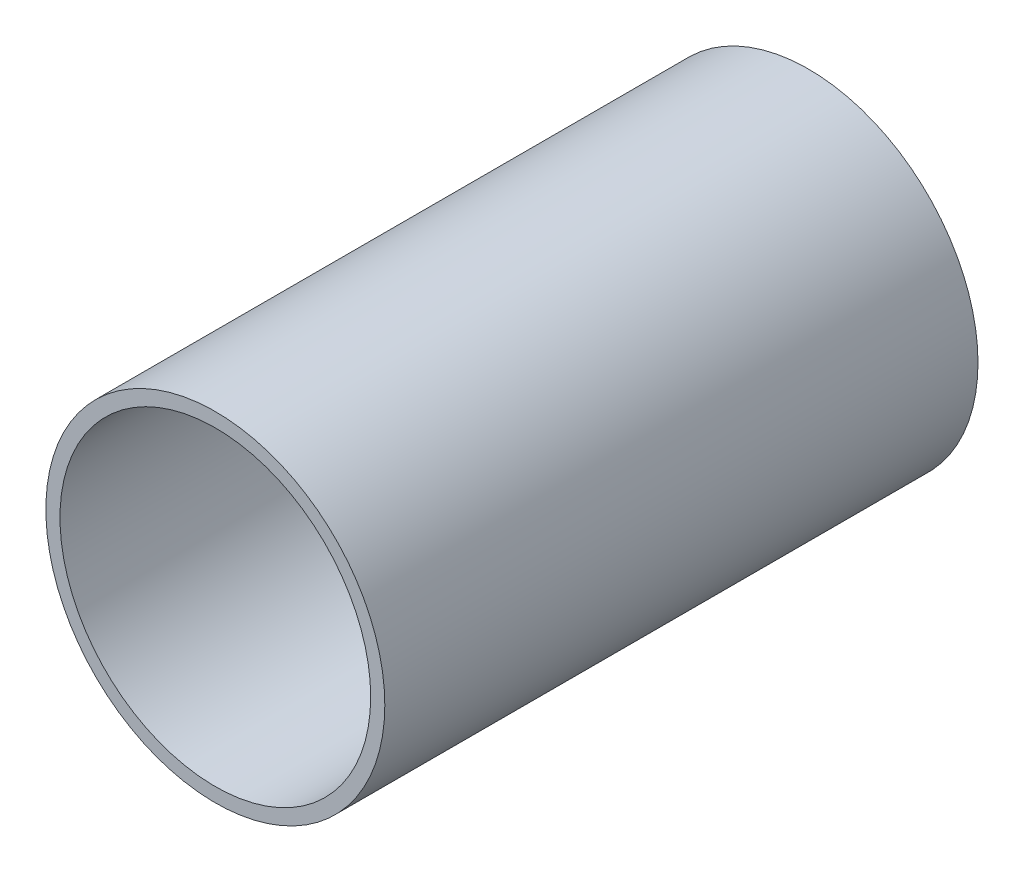
ISO-10303-21;
HEADER;
FILE_DESCRIPTION(('STEP AP214'),'2;1');
FILE_NAME('part.step','',(''),(''),'','','');
FILE_SCHEMA(('AUTOMOTIVE_DESIGN { 1 0 10303 214 1 1 1 1 }'));
ENDSEC;
DATA;
#1=APPLICATION_CONTEXT('core data for automotive mechanical design processes');
#2=APPLICATION_PROTOCOL_DEFINITION('international standard','automotive_design',2000,#1);
#3=PRODUCT_CONTEXT('',#1,'mechanical');
#4=PRODUCT('Part','Part','',(#3));
#5=PRODUCT_RELATED_PRODUCT_CATEGORY('part','',(#4));
#6=PRODUCT_DEFINITION_FORMATION('','',#4);
#7=PRODUCT_DEFINITION_CONTEXT('part definition',#1,'design');
#8=PRODUCT_DEFINITION('design','',#6,#7);
#9=PRODUCT_DEFINITION_SHAPE('','',#8);
#10=(LENGTH_UNIT() NAMED_UNIT(*) SI_UNIT(.MILLI.,.METRE.));
#11=(NAMED_UNIT(*) PLANE_ANGLE_UNIT() SI_UNIT($,.RADIAN.));
#12=(NAMED_UNIT(*) SI_UNIT($,.STERADIAN.) SOLID_ANGLE_UNIT());
#13=UNCERTAINTY_MEASURE_WITH_UNIT(LENGTH_MEASURE(1.E-05),#10,'distance_accuracy_value','');
#14=(GEOMETRIC_REPRESENTATION_CONTEXT(3) GLOBAL_UNCERTAINTY_ASSIGNED_CONTEXT((#13)) GLOBAL_UNIT_ASSIGNED_CONTEXT((#10,
#11,#12)) REPRESENTATION_CONTEXT('',''));
#15=CARTESIAN_POINT('',(0.,0.,0.));
#16=DIRECTION('',(0.,0.,1.));
#17=DIRECTION('',(1.,0.,0.));
#18=AXIS2_PLACEMENT_3D('',#15,#16,#17);
#19=CARTESIAN_POINT('',(0.,0.,21.));
#20=DIRECTION('',(0.,0.,1.));
#21=DIRECTION('',(1.,0.,0.));
#22=AXIS2_PLACEMENT_3D('',#19,#20,#21);
#23=PLANE('',#22);
#24=CARTESIAN_POINT('',(0.,0.,21.));
#25=DIRECTION('',(0.,0.,1.));
#26=DIRECTION('',(1.,0.,0.));
#27=AXIS2_PLACEMENT_3D('',#24,#25,#26);
#28=CIRCLE('',#27,12.);
#29=CARTESIAN_POINT('',(12.,0.,21.));
#30=VERTEX_POINT('',#29);
#31=EDGE_CURVE('E10',#30,#30,#28,.T.);
#32=ORIENTED_EDGE('',*,*,#31,.T.);
#33=EDGE_LOOP('',(#32));
#34=FACE_BOUND('',#33,.T.);
#35=CARTESIAN_POINT('',(0.,0.,21.));
#36=DIRECTION('',(0.,0.,1.));
#37=DIRECTION('',(1.,0.,0.));
#38=AXIS2_PLACEMENT_3D('',#35,#36,#37);
#39=CIRCLE('',#38,11.);
#40=CARTESIAN_POINT('',(11.,0.,21.));
#41=VERTEX_POINT('',#40);
#42=EDGE_CURVE('E42',#41,#41,#39,.T.);
#43=ORIENTED_EDGE('',*,*,#42,.F.);
#44=EDGE_LOOP('',(#43));
#45=FACE_BOUND('',#44,.T.);
#46=ADVANCED_FACE('F31',(#34,#45),#23,.T.);
#47=CARTESIAN_POINT('',(0.,0.,-21.));
#48=DIRECTION('',(0.,0.,1.));
#49=DIRECTION('',(1.,0.,0.));
#50=AXIS2_PLACEMENT_3D('',#47,#48,#49);
#51=PLANE('',#50);
#52=CARTESIAN_POINT('',(0.,0.,-21.));
#53=DIRECTION('',(0.,0.,1.));
#54=DIRECTION('',(1.,0.,0.));
#55=AXIS2_PLACEMENT_3D('',#52,#53,#54);
#56=CIRCLE('',#55,12.);
#57=CARTESIAN_POINT('',(12.,0.,-21.));
#58=VERTEX_POINT('',#57);
#59=EDGE_CURVE('E35',#58,#58,#56,.T.);
#60=ORIENTED_EDGE('',*,*,#59,.F.);
#61=EDGE_LOOP('',(#60));
#62=FACE_BOUND('',#61,.T.);
#63=CARTESIAN_POINT('',(0.,0.,-21.));
#64=DIRECTION('',(0.,0.,1.));
#65=DIRECTION('',(1.,0.,0.));
#66=AXIS2_PLACEMENT_3D('',#63,#64,#65);
#67=CIRCLE('',#66,11.);
#68=CARTESIAN_POINT('',(11.,0.,-21.));
#69=VERTEX_POINT('',#68);
#70=EDGE_CURVE('E44',#69,#69,#67,.T.);
#71=ORIENTED_EDGE('',*,*,#70,.T.);
#72=EDGE_LOOP('',(#71));
#73=FACE_BOUND('',#72,.T.);
#74=ADVANCED_FACE('F54',(#62,#73),#51,.F.);
#75=CARTESIAN_POINT('',(0.,0.,21.));
#76=DIRECTION('',(0.,0.,-1.));
#77=DIRECTION('',(-1.,0.,0.));
#78=AXIS2_PLACEMENT_3D('',#75,#76,#77);
#79=CYLINDRICAL_SURFACE('',#78,12.);
#80=ORIENTED_EDGE('',*,*,#31,.F.);
#81=EDGE_LOOP('',(#80));
#82=FACE_BOUND('',#81,.T.);
#83=ORIENTED_EDGE('',*,*,#59,.T.);
#84=EDGE_LOOP('',(#83));
#85=FACE_BOUND('',#84,.T.);
#86=ADVANCED_FACE('F33',(#82,#85),#79,.T.);
#87=CARTESIAN_POINT('',(0.,0.,21.));
#88=DIRECTION('',(0.,0.,-1.));
#89=DIRECTION('',(-1.,0.,0.));
#90=AXIS2_PLACEMENT_3D('',#87,#88,#89);
#91=CYLINDRICAL_SURFACE('',#90,11.);
#92=ORIENTED_EDGE('',*,*,#42,.T.);
#93=EDGE_LOOP('',(#92));
#94=FACE_BOUND('',#93,.T.);
#95=ORIENTED_EDGE('',*,*,#70,.F.);
#96=EDGE_LOOP('',(#95));
#97=FACE_BOUND('',#96,.T.);
#98=ADVANCED_FACE('F50',(#94,#97),#91,.F.);
#99=CLOSED_SHELL('',(#46,#74,#86,#98));
#100=MANIFOLD_SOLID_BREP('B2',#99);
#101=ADVANCED_BREP_SHAPE_REPRESENTATION('',(#18,#100),#14);
#102=SHAPE_DEFINITION_REPRESENTATION(#9,#101);
ENDSEC;
END-ISO-10303-21;
